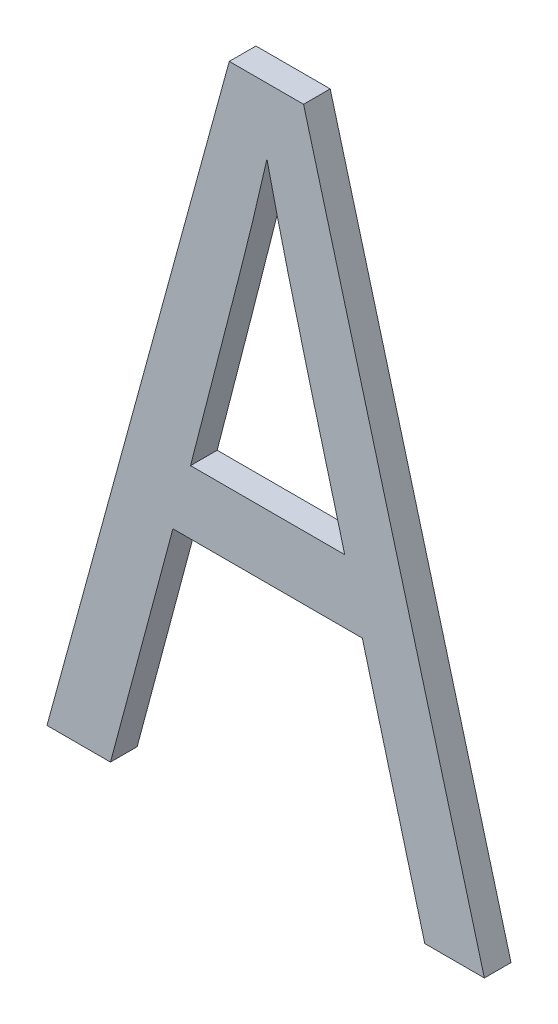
ISO-10303-21;
HEADER;
FILE_DESCRIPTION(('STEP AP214'),'2;1');
FILE_NAME('part.step','',(''),(''),'','','');
FILE_SCHEMA(('AUTOMOTIVE_DESIGN { 1 0 10303 214 1 1 1 1 }'));
ENDSEC;
DATA;
#1=APPLICATION_CONTEXT('core data for automotive mechanical design processes');
#2=APPLICATION_PROTOCOL_DEFINITION('international standard','automotive_design',2000,#1);
#3=PRODUCT_CONTEXT('',#1,'mechanical');
#4=PRODUCT('Part','Part','',(#3));
#5=PRODUCT_RELATED_PRODUCT_CATEGORY('part','',(#4));
#6=PRODUCT_DEFINITION_FORMATION('','',#4);
#7=PRODUCT_DEFINITION_CONTEXT('part definition',#1,'design');
#8=PRODUCT_DEFINITION('design','',#6,#7);
#9=PRODUCT_DEFINITION_SHAPE('','',#8);
#10=(LENGTH_UNIT() NAMED_UNIT(*) SI_UNIT(.MILLI.,.METRE.));
#11=(NAMED_UNIT(*) PLANE_ANGLE_UNIT() SI_UNIT($,.RADIAN.));
#12=(NAMED_UNIT(*) SI_UNIT($,.STERADIAN.) SOLID_ANGLE_UNIT());
#13=UNCERTAINTY_MEASURE_WITH_UNIT(LENGTH_MEASURE(1.E-05),#10,'distance_accuracy_value','');
#14=(GEOMETRIC_REPRESENTATION_CONTEXT(3) GLOBAL_UNCERTAINTY_ASSIGNED_CONTEXT((#13)) GLOBAL_UNIT_ASSIGNED_CONTEXT((#10,
#11,#12)) REPRESENTATION_CONTEXT('',''));
#15=CARTESIAN_POINT('',(0.,0.,0.));
#16=DIRECTION('',(0.,0.,1.));
#17=DIRECTION('',(1.,0.,0.));
#18=AXIS2_PLACEMENT_3D('',#15,#16,#17);
#19=CARTESIAN_POINT('',(161.373182957808,126.608883353261,-39.1));
#20=DIRECTION('',(0.,0.,-1.));
#21=DIRECTION('',(-1.,0.,0.));
#22=AXIS2_PLACEMENT_3D('',#19,#20,#21);
#23=PLANE('',#22);
#24=CARTESIAN_POINT('',(161.510052266919,127.1671696976,-39.1));
#25=CARTESIAN_POINT('',(161.517435763563,127.134663899588,-39.1));
#26=CARTESIAN_POINT('',(161.524951125907,127.102188321371,-39.1));
#27=CARTESIAN_POINT('',(161.536395264339,127.05351530328,-39.1));
#28=CARTESIAN_POINT('',(161.540238480813,127.037297738906,-39.1));
#29=CARTESIAN_POINT('',(161.546042747483,127.012980828554,-39.1));
#30=CARTESIAN_POINT('',(161.547984075584,127.004876769078,-39.1));
#31=CARTESIAN_POINT('',(161.551879443766,126.988671705049,-39.1));
#32=CARTESIAN_POINT('',(161.553833483845,126.980570700495,-39.1));
#33=CARTESIAN_POINT('',(161.557753829251,126.964371661219,-39.1));
#34=CARTESIAN_POINT('',(161.559720134577,126.956273626495,-39.1));
#35=CARTESIAN_POINT('',(161.565636829954,126.93198383587,-39.1));
#36=CARTESIAN_POINT('',(161.569604996497,126.915796405606,-39.1));
#37=CARTESIAN_POINT('',(161.575590537918,126.89152348857,-39.1));
#38=CARTESIAN_POINT('',(161.57759126619,126.883433890835,-39.1));
#39=CARTESIAN_POINT('',(161.581603483805,126.867257363488,-39.1));
#40=CARTESIAN_POINT('',(161.583614973148,126.859170433877,-39.1));
#41=CARTESIAN_POINT('',(161.587648387726,126.842999178711,-39.1));
#42=CARTESIAN_POINT('',(161.589670312961,126.834914853156,-39.1));
#43=CARTESIAN_POINT('',(161.595751282928,126.810665673869,-39.1));
#44=CARTESIAN_POINT('',(161.599825519707,126.79450462644,-39.1));
#45=CARTESIAN_POINT('',(161.605965553908,126.77027033519,-39.1));
#46=CARTESIAN_POINT('',(161.608017011211,126.76219345378,-39.1));
#47=CARTESIAN_POINT('',(161.612129241238,126.746042062139,-39.1));
#48=CARTESIAN_POINT('',(161.614190013962,126.737967551909,-39.1));
#49=CARTESIAN_POINT('',(161.618320580844,126.7218208397,-39.1));
#50=CARTESIAN_POINT('',(161.620390375002,126.71374863772,-39.1));
#51=CARTESIAN_POINT('',(161.626613195052,126.689535478171,-39.1));
#52=CARTESIAN_POINT('',(161.630779656958,126.673397973119,-39.1));
#53=CARTESIAN_POINT('',(161.639140546099,126.64113021702,-39.1));
#54=CARTESIAN_POINT('',(161.643334973328,126.624999965971,-39.1));
#55=CARTESIAN_POINT('',(161.649645501117,126.600809521214,-39.1));
#56=CARTESIAN_POINT('',(161.651752157903,126.592746862747,-39.1));
#57=CARTESIAN_POINT('',(161.658080881588,126.568561174378,-39.1));
#58=CARTESIAN_POINT('',(161.662311701118,126.552440434185,-39.1));
#59=CARTESIAN_POINT('',(161.67079336986,126.520204227042,-39.1));
#60=CARTESIAN_POINT('',(161.675044219069,126.504088760092,-39.1));
#61=CARTESIAN_POINT('',(161.681433002693,126.479918869128,-39.1));
#62=CARTESIAN_POINT('',(161.683564682052,126.471862790951,-39.1));
#63=CARTESIAN_POINT('',(161.689965350958,126.447696046413,-39.1));
#64=CARTESIAN_POINT('',(161.694239971073,126.431586871042,-39.1));
#65=CARTESIAN_POINT('',(161.700660659156,126.407425437448,-39.1));
#66=CARTESIAN_POINT('',(161.702802348086,126.399372014809,-39.1));
#67=CARTESIAN_POINT('',(161.709231169061,126.375212745389,-39.1));
#68=CARTESIAN_POINT('',(161.713522055195,126.35910789748,-39.1));
#69=CARTESIAN_POINT('',(161.722110504658,126.326899983344,-39.1));
#70=CARTESIAN_POINT('',(161.726408067987,126.310796917116,-39.1));
#71=CARTESIAN_POINT('',(161.732856921935,126.286642987885,-39.1));
#72=CARTESIAN_POINT('',(161.735006958061,126.278591789883,-39.1));
#73=CARTESIAN_POINT('',(161.741457696262,126.2544383641,-39.1));
#74=CARTESIAN_POINT('',(161.745759028163,126.23833630453,-39.1));
#75=CARTESIAN_POINT('',(161.752209787055,126.214182884278,-39.1));
#76=CARTESIAN_POINT('',(161.754359833527,126.206131689043,-39.1));
#77=CARTESIAN_POINT('',(161.760808728838,126.181977770947,-39.1));
#78=CARTESIAN_POINT('',(161.765106333537,126.165874715841,-39.1));
#79=CARTESIAN_POINT('',(161.773694893296,126.133666831414,-39.1));
#80=CARTESIAN_POINT('',(161.777985848356,126.117562002093,-39.1));
#81=CARTESIAN_POINT('',(161.784414793521,126.093402765769,-39.1));
#82=CARTESIAN_POINT('',(161.786556527321,126.085349354999,-39.1));
#83=CARTESIAN_POINT('',(161.790894195654,126.069026843694,-39.1));
#84=CARTESIAN_POINT('',(161.793090051425,126.060757722225,-39.1));
#85=CARTESIAN_POINT('',(161.797478241987,126.044218543595,-39.1));
#86=CARTESIAN_POINT('',(161.799670576775,126.035948486433,-39.1));
#87=CARTESIAN_POINT('',(161.801860925255,126.027677903,-39.1));
#88=B_SPLINE_CURVE_WITH_KNOTS('',3,(#24,#25,#26,#27,#28,#29,#30,#31,#32,#33,#34,#35,#36,#37,#38,
#39,#40,#41,#42,#43,#44,#45,#46,#47,#48,#49,#50,#51,#52,#53,#54,#55,#56,#57,#58,#59,#60,#61,#62,
#63,#64,#65,#66,#67,#68,#69,#70,#71,#72,#73,#74,#75,#76,#77,#78,#79,#80,#81,#82,#83,#84,#85,#86,
#87),.UNSPECIFIED.,.F.,.F.,(4,2,2,2,2,2,2,2,2,2,2,2,2,2,2,2,2,2,2,2,2,2,2,2,2,2,2,2,2,2,2,4),
(0.,0.100000764839208,0.150000837838386,0.175000845900893,0.200000853410547,0.225000860419937,
0.275000911743578,0.300000917509053,0.32500092293011,0.350000928035581,0.400000965840457,
0.425000970143834,0.450000974220315,0.475000978086766,0.525001004794338,0.575001022657182,
0.600001024457791,0.650001036364141,0.700001044968254,0.725001045750875,0.775001050405058,
0.800001050777549,0.850001052685995,0.900001053432861,0.925001053456294,0.975001053464078,
1.00000105347876,1.05000105395143,1.1000010554029,1.12500105573741,1.15066818128077,
1.17633531127952),.UNSPECIFIED.);
#89=CARTESIAN_POINT('',(161.510052266919,127.1671696976,-39.1));
#90=VERTEX_POINT('',#89);
#91=CARTESIAN_POINT('',(161.801860925255,126.027677903,-39.1));
#92=VERTEX_POINT('',#91);
#93=EDGE_CURVE('E24',#90,#92,#88,.T.);
#94=ORIENTED_EDGE('',*,*,#93,.F.);
#95=CARTESIAN_POINT('',(161.223292201287,126.027677903,-39.1));
#96=CARTESIAN_POINT('',(161.239935220726,126.092233706417,-39.1));
#97=CARTESIAN_POINT('',(161.256586244339,126.156787476072,-39.1));
#98=CARTESIAN_POINT('',(161.289888209114,126.285894695833,-39.1));
#99=CARTESIAN_POINT('',(161.306539150275,126.35044814594,-39.1));
#100=CARTESIAN_POINT('',(161.339825189205,126.47955975276,-39.1));
#101=CARTESIAN_POINT('',(161.356460286816,126.544117909515,-39.1));
#102=CARTESIAN_POINT('',(161.38510711591,126.655064135204,-39.1));
#103=CARTESIAN_POINT('',(161.397103371138,126.701456136465,-39.1));
#104=CARTESIAN_POINT('',(161.420769082471,126.794322567169,-39.1));
#105=CARTESIAN_POINT('',(161.432438546701,126.840796994532,-39.1));
#106=CARTESIAN_POINT('',(161.45538984158,126.933850480262,-39.1));
#107=CARTESIAN_POINT('',(161.466671603444,126.98042955565,-39.1));
#108=CARTESIAN_POINT('',(161.488750090456,127.073706762007,-39.1));
#109=CARTESIAN_POINT('',(161.499546771949,127.120404903293,-39.1));
#110=CARTESIAN_POINT('',(161.510052266919,127.1671696976,-39.1));
#111=B_SPLINE_CURVE_WITH_KNOTS('',3,(#95,#96,#97,#98,#99,#100,#101,#102,#103,#104,#105,#106,
#107,#108,#109,#110),.UNSPECIFIED.,.F.,.F.,(4,2,2,2,2,2,2,4),(0.,0.200000000000011,
0.399999009959019,0.599999999999992,0.743753425586705,0.887503273823785,1.03127849489464,
1.17506662901091),.UNSPECIFIED.);
#112=CARTESIAN_POINT('',(161.223292201287,126.027677903,-39.1));
#113=VERTEX_POINT('',#112);
#114=EDGE_CURVE('E62',#113,#90,#111,.T.);
#115=ORIENTED_EDGE('',*,*,#114,.F.);
#116=DIRECTION('',(1.,0.,0.));
#117=VECTOR('',#116,1.);
#118=CARTESIAN_POINT('',(161.801860925255,126.027677903,-39.1));
#119=LINE('',#118,#117);
#120=EDGE_CURVE('E126',#92,#113,#119,.F.);
#121=ORIENTED_EDGE('',*,*,#120,.F.);
#122=EDGE_LOOP('',(#94,#115,#121));
#123=FACE_BOUND('',#122,.T.);
#124=DIRECTION('',(0.258484479547322,-0.966015410763798,0.));
#125=VECTOR('',#124,1.);
#126=CARTESIAN_POINT('',(161.867997489688,125.789456621899,-39.1));
#127=LINE('',#126,#125);
#128=CARTESIAN_POINT('',(161.867997489688,125.789456621899,-39.1));
#129=VERTEX_POINT('',#128);
#130=CARTESIAN_POINT('',(162.10225219119,124.913993413852,-39.1));
#131=VERTEX_POINT('',#130);
#132=EDGE_CURVE('E211',#129,#131,#127,.T.);
#133=ORIENTED_EDGE('',*,*,#132,.F.);
#134=DIRECTION('',(1.,0.,0.));
#135=VECTOR('',#134,1.);
#136=CARTESIAN_POINT('',(161.157155636854,125.789456621899,-39.1));
#137=LINE('',#136,#135);
#138=CARTESIAN_POINT('',(161.157155636854,125.789456621899,-39.1));
#139=VERTEX_POINT('',#138);
#140=EDGE_CURVE('E206',#139,#129,#137,.T.);
#141=ORIENTED_EDGE('',*,*,#140,.F.);
#142=DIRECTION('',(0.258484479547336,0.966015410763795,0.));
#143=VECTOR('',#142,1.);
#144=CARTESIAN_POINT('',(160.922900935353,124.913993413852,-39.1));
#145=LINE('',#144,#143);
#146=CARTESIAN_POINT('',(160.922900935353,124.913993413852,-39.1));
#147=VERTEX_POINT('',#146);
#148=EDGE_CURVE('E72',#147,#139,#145,.T.);
#149=ORIENTED_EDGE('',*,*,#148,.F.);
#150=DIRECTION('',(1.,0.,0.));
#151=VECTOR('',#150,1.);
#152=CARTESIAN_POINT('',(160.684607359687,124.913993413852,-39.1));
#153=LINE('',#152,#151);
#154=CARTESIAN_POINT('',(160.684607359687,124.913993413852,-39.1));
#155=VERTEX_POINT('',#154);
#156=EDGE_CURVE('E112',#155,#147,#153,.T.);
#157=ORIENTED_EDGE('',*,*,#156,.F.);
#158=DIRECTION('',(-0.263931093483595,-0.964541537670905,0.));
#159=VECTOR('',#158,1.);
#160=CARTESIAN_POINT('',(161.368691671185,127.413993413853,-39.1));
#161=LINE('',#160,#159);
#162=CARTESIAN_POINT('',(161.368691671185,127.413993413853,-39.1));
#163=VERTEX_POINT('',#162);
#164=EDGE_CURVE('E103',#163,#155,#161,.T.);
#165=ORIENTED_EDGE('',*,*,#164,.F.);
#166=DIRECTION('',(1.,0.,0.));
#167=VECTOR('',#166,1.);
#168=CARTESIAN_POINT('',(161.647373988489,127.413993413853,-39.1));
#169=LINE('',#168,#167);
#170=CARTESIAN_POINT('',(161.647373988489,127.413993413853,-39.1));
#171=VERTEX_POINT('',#170);
#172=EDGE_CURVE('E97',#171,#163,#169,.F.);
#173=ORIENTED_EDGE('',*,*,#172,.F.);
#174=DIRECTION('',(-0.26193604523983,0.965085233647328,0.));
#175=VECTOR('',#174,1.);
#176=CARTESIAN_POINT('',(162.325904848012,124.913993413852,-39.1));
#177=LINE('',#176,#175);
#178=CARTESIAN_POINT('',(162.325904848012,124.913993413852,-39.1));
#179=VERTEX_POINT('',#178);
#180=EDGE_CURVE('E221',#179,#171,#177,.T.);
#181=ORIENTED_EDGE('',*,*,#180,.F.);
#182=DIRECTION('',(1.,0.,0.));
#183=VECTOR('',#182,1.);
#184=CARTESIAN_POINT('',(162.10225219119,124.913993413852,-39.1));
#185=LINE('',#184,#183);
#186=EDGE_CURVE('E216',#131,#179,#185,.T.);
#187=ORIENTED_EDGE('',*,*,#186,.F.);
#188=EDGE_LOOP('',(#133,#141,#149,#157,#165,#173,#181,#187));
#189=FACE_BOUND('',#188,.T.);
#190=ADVANCED_FACE('F17',(#123,#189),#23,.T.);
#191=CARTESIAN_POINT('',(160.684607359687,124.913993413852,-39.1));
#192=DIRECTION('',(0.,-1.,0.));
#193=DIRECTION('',(0.,0.,-1.));
#194=AXIS2_PLACEMENT_3D('',#191,#192,#193);
#195=PLANE('',#194);
#196=ORIENTED_EDGE('',*,*,#156,.T.);
#197=DIRECTION('',(0.,0.,1.));
#198=VECTOR('',#197,1.);
#199=CARTESIAN_POINT('',(160.922900935353,124.913993413852,-39.1));
#200=LINE('',#199,#198);
#201=CARTESIAN_POINT('',(160.922900935353,124.913993413852,-39.));
#202=VERTEX_POINT('',#201);
#203=EDGE_CURVE('E198',#202,#147,#200,.F.);
#204=ORIENTED_EDGE('',*,*,#203,.F.);
#205=DIRECTION('',(-1.,0.,0.));
#206=VECTOR('',#205,1.);
#207=CARTESIAN_POINT('',(161.373182957808,124.913993413852,-39.));
#208=LINE('',#207,#206);
#209=CARTESIAN_POINT('',(160.684607359687,124.913993413852,-39.));
#210=VERTEX_POINT('',#209);
#211=EDGE_CURVE('E121',#202,#210,#208,.T.);
#212=ORIENTED_EDGE('',*,*,#211,.T.);
#213=DIRECTION('',(0.,0.,1.));
#214=VECTOR('',#213,1.);
#215=CARTESIAN_POINT('',(160.684607359687,124.913993413852,-39.1));
#216=LINE('',#215,#214);
#217=EDGE_CURVE('E108',#155,#210,#216,.T.);
#218=ORIENTED_EDGE('',*,*,#217,.F.);
#219=EDGE_LOOP('',(#196,#204,#212,#218));
#220=FACE_BOUND('',#219,.T.);
#221=ADVANCED_FACE('F119',(#220),#195,.T.);
#222=CARTESIAN_POINT('',(161.368691671185,127.413993413853,-39.1));
#223=DIRECTION('',(-0.964541537670905,0.263931093483595,0.));
#224=DIRECTION('',(-0.263931093483595,-0.964541537670905,0.));
#225=AXIS2_PLACEMENT_3D('',#222,#223,#224);
#226=PLANE('',#225);
#227=ORIENTED_EDGE('',*,*,#164,.T.);
#228=ORIENTED_EDGE('',*,*,#217,.T.);
#229=DIRECTION('',(0.26393109348361,0.964541537670901,0.));
#230=VECTOR('',#229,1.);
#231=CARTESIAN_POINT('',(160.684607359687,124.913993413852,-39.));
#232=LINE('',#231,#230);
#233=CARTESIAN_POINT('',(161.368691671185,127.413993413853,-39.));
#234=VERTEX_POINT('',#233);
#235=EDGE_CURVE('E231',#210,#234,#232,.T.);
#236=ORIENTED_EDGE('',*,*,#235,.T.);
#237=DIRECTION('',(0.,0.,1.));
#238=VECTOR('',#237,1.);
#239=CARTESIAN_POINT('',(161.368691671185,127.413993413853,-39.1));
#240=LINE('',#239,#238);
#241=EDGE_CURVE('E110',#163,#234,#240,.T.);
#242=ORIENTED_EDGE('',*,*,#241,.F.);
#243=EDGE_LOOP('',(#227,#228,#236,#242));
#244=FACE_BOUND('',#243,.T.);
#245=ADVANCED_FACE('F105',(#244),#226,.T.);
#246=CARTESIAN_POINT('',(161.647373988489,127.413993413853,-39.1));
#247=DIRECTION('',(0.,1.,0.));
#248=DIRECTION('',(0.,0.,1.));
#249=AXIS2_PLACEMENT_3D('',#246,#247,#248);
#250=PLANE('',#249);
#251=ORIENTED_EDGE('',*,*,#172,.T.);
#252=ORIENTED_EDGE('',*,*,#241,.T.);
#253=DIRECTION('',(-1.,0.,0.));
#254=VECTOR('',#253,1.);
#255=CARTESIAN_POINT('',(161.373182957808,127.413993413853,-39.));
#256=LINE('',#255,#254);
#257=CARTESIAN_POINT('',(161.647373988489,127.413993413853,-39.));
#258=VERTEX_POINT('',#257);
#259=EDGE_CURVE('E226',#234,#258,#256,.F.);
#260=ORIENTED_EDGE('',*,*,#259,.T.);
#261=DIRECTION('',(0.,0.,1.));
#262=VECTOR('',#261,1.);
#263=CARTESIAN_POINT('',(161.647373988489,127.413993413853,-39.1));
#264=LINE('',#263,#262);
#265=EDGE_CURVE('E218',#171,#258,#264,.T.);
#266=ORIENTED_EDGE('',*,*,#265,.F.);
#267=EDGE_LOOP('',(#251,#252,#260,#266));
#268=FACE_BOUND('',#267,.T.);
#269=ADVANCED_FACE('F169',(#268),#250,.T.);
#270=CARTESIAN_POINT('',(162.325904848012,124.913993413852,-39.1));
#271=DIRECTION('',(0.965085233647328,0.26193604523983,0.));
#272=DIRECTION('',(-0.26193604523983,0.965085233647328,0.));
#273=AXIS2_PLACEMENT_3D('',#270,#271,#272);
#274=PLANE('',#273);
#275=ORIENTED_EDGE('',*,*,#180,.T.);
#276=ORIENTED_EDGE('',*,*,#265,.T.);
#277=DIRECTION('',(0.261936045239833,-0.965085233647327,0.));
#278=VECTOR('',#277,1.);
#279=CARTESIAN_POINT('',(161.647373988489,127.413993413853,-39.));
#280=LINE('',#279,#278);
#281=CARTESIAN_POINT('',(162.325904848012,124.913993413852,-39.));
#282=VERTEX_POINT('',#281);
#283=EDGE_CURVE('E234',#258,#282,#280,.T.);
#284=ORIENTED_EDGE('',*,*,#283,.T.);
#285=DIRECTION('',(0.,0.,-1.));
#286=VECTOR('',#285,1.);
#287=CARTESIAN_POINT('',(162.325904848012,124.913993413852,-39.1));
#288=LINE('',#287,#286);
#289=EDGE_CURVE('E213',#179,#282,#288,.F.);
#290=ORIENTED_EDGE('',*,*,#289,.F.);
#291=EDGE_LOOP('',(#275,#276,#284,#290));
#292=FACE_BOUND('',#291,.T.);
#293=ADVANCED_FACE('F165',(#292),#274,.T.);
#294=CARTESIAN_POINT('',(162.10225219119,124.913993413852,-39.1));
#295=DIRECTION('',(0.,-1.,0.));
#296=DIRECTION('',(0.,0.,-1.));
#297=AXIS2_PLACEMENT_3D('',#294,#295,#296);
#298=PLANE('',#297);
#299=ORIENTED_EDGE('',*,*,#186,.T.);
#300=ORIENTED_EDGE('',*,*,#289,.T.);
#301=DIRECTION('',(-1.,0.,0.));
#302=VECTOR('',#301,1.);
#303=CARTESIAN_POINT('',(161.373182957808,124.913993413852,-39.));
#304=LINE('',#303,#302);
#305=CARTESIAN_POINT('',(162.10225219119,124.913993413852,-39.));
#306=VERTEX_POINT('',#305);
#307=EDGE_CURVE('E252',#282,#306,#304,.T.);
#308=ORIENTED_EDGE('',*,*,#307,.T.);
#309=DIRECTION('',(0.,0.,1.));
#310=VECTOR('',#309,1.);
#311=CARTESIAN_POINT('',(162.10225219119,124.913993413852,-39.1));
#312=LINE('',#311,#310);
#313=EDGE_CURVE('E208',#131,#306,#312,.T.);
#314=ORIENTED_EDGE('',*,*,#313,.F.);
#315=EDGE_LOOP('',(#299,#300,#308,#314));
#316=FACE_BOUND('',#315,.T.);
#317=ADVANCED_FACE('F161',(#316),#298,.T.);
#318=CARTESIAN_POINT('',(161.867997489688,125.789456621899,-39.1));
#319=DIRECTION('',(-0.966015410763798,-0.258484479547322,0.));
#320=DIRECTION('',(0.258484479547322,-0.966015410763798,0.));
#321=AXIS2_PLACEMENT_3D('',#318,#319,#320);
#322=PLANE('',#321);
#323=ORIENTED_EDGE('',*,*,#132,.T.);
#324=ORIENTED_EDGE('',*,*,#313,.T.);
#325=DIRECTION('',(-0.258484479547393,0.966015410763779,0.));
#326=VECTOR('',#325,1.);
#327=CARTESIAN_POINT('',(162.10225219119,124.913993413852,-39.));
#328=LINE('',#327,#326);
#329=CARTESIAN_POINT('',(161.867997489688,125.789456621899,-39.));
#330=VERTEX_POINT('',#329);
#331=EDGE_CURVE('E247',#306,#330,#328,.T.);
#332=ORIENTED_EDGE('',*,*,#331,.T.);
#333=DIRECTION('',(0.,0.,-1.));
#334=VECTOR('',#333,1.);
#335=CARTESIAN_POINT('',(161.867997489688,125.789456621899,-39.1));
#336=LINE('',#335,#334);
#337=EDGE_CURVE('E203',#129,#330,#336,.F.);
#338=ORIENTED_EDGE('',*,*,#337,.F.);
#339=EDGE_LOOP('',(#323,#324,#332,#338));
#340=FACE_BOUND('',#339,.T.);
#341=ADVANCED_FACE('F157',(#340),#322,.T.);
#342=CARTESIAN_POINT('',(161.157155636854,125.789456621899,-39.1));
#343=DIRECTION('',(0.,-1.,0.));
#344=DIRECTION('',(0.,0.,-1.));
#345=AXIS2_PLACEMENT_3D('',#342,#343,#344);
#346=PLANE('',#345);
#347=ORIENTED_EDGE('',*,*,#140,.T.);
#348=ORIENTED_EDGE('',*,*,#337,.T.);
#349=DIRECTION('',(-1.,0.,0.));
#350=VECTOR('',#349,1.);
#351=CARTESIAN_POINT('',(161.373182957808,125.789456621899,-39.));
#352=LINE('',#351,#350);
#353=CARTESIAN_POINT('',(161.157155636854,125.789456621899,-39.));
#354=VERTEX_POINT('',#353);
#355=EDGE_CURVE('E244',#330,#354,#352,.T.);
#356=ORIENTED_EDGE('',*,*,#355,.T.);
#357=DIRECTION('',(0.,0.,1.));
#358=VECTOR('',#357,1.);
#359=CARTESIAN_POINT('',(161.157155636854,125.789456621899,-39.1));
#360=LINE('',#359,#358);
#361=EDGE_CURVE('E189',#139,#354,#360,.T.);
#362=ORIENTED_EDGE('',*,*,#361,.F.);
#363=EDGE_LOOP('',(#347,#348,#356,#362));
#364=FACE_BOUND('',#363,.T.);
#365=ADVANCED_FACE('F154',(#364),#346,.T.);
#366=CARTESIAN_POINT('',(160.922900935353,124.913993413852,-39.1));
#367=DIRECTION('',(0.966015410763795,-0.258484479547336,0.));
#368=DIRECTION('',(0.258484479547336,0.966015410763795,0.));
#369=AXIS2_PLACEMENT_3D('',#366,#367,#368);
#370=PLANE('',#369);
#371=ORIENTED_EDGE('',*,*,#148,.T.);
#372=ORIENTED_EDGE('',*,*,#361,.T.);
#373=DIRECTION('',(-0.258484479547364,-0.966015410763787,0.));
#374=VECTOR('',#373,1.);
#375=CARTESIAN_POINT('',(161.157155636854,125.789456621899,-39.));
#376=LINE('',#375,#374);
#377=EDGE_CURVE('E243',#354,#202,#376,.T.);
#378=ORIENTED_EDGE('',*,*,#377,.T.);
#379=ORIENTED_EDGE('',*,*,#203,.T.);
#380=EDGE_LOOP('',(#371,#372,#378,#379));
#381=FACE_BOUND('',#380,.T.);
#382=ADVANCED_FACE('F150',(#381),#370,.T.);
#383=CARTESIAN_POINT('',(161.510052266919,127.1671696976,-39.1));
#384=CARTESIAN_POINT('',(161.510052266919,127.1671696976,-39.));
#385=CARTESIAN_POINT('',(161.54236326023,127.024898654721,-39.1));
#386=CARTESIAN_POINT('',(161.54236326023,127.024898654721,-39.));
#387=CARTESIAN_POINT('',(161.581742283327,126.863437564197,-39.1));
#388=CARTESIAN_POINT('',(161.581742283327,126.863437564197,-39.));
#389=CARTESIAN_POINT('',(161.684691151942,126.46449500019,-39.1));
#390=CARTESIAN_POINT('',(161.684691151942,126.46449500019,-39.));
#391=CARTESIAN_POINT('',(161.743970395574,126.246267985936,-39.1));
#392=CARTESIAN_POINT('',(161.743970395574,126.246267985936,-39.));
#393=CARTESIAN_POINT('',(161.801860925255,126.027677903,-39.1));
#394=CARTESIAN_POINT('',(161.801860925255,126.027677903,-39.));
#395=B_SPLINE_SURFACE_WITH_KNOTS('',3,1,((#383,#384),(#385,#386),(#387,#388),(#389,#390),(#391,
#392),(#393,#394)),.UNSPECIFIED.,.F.,.F.,.F.,(4,2,4),(2,2),(0.,0.45116622949396,1.),(1.,1.1),.UNSPECIFIED.);
#396=DIRECTION('',(0.,0.,1.));
#397=VECTOR('',#396,1.);
#398=CARTESIAN_POINT('',(161.801860925255,126.027677903,-39.1));
#399=LINE('',#398,#397);
#400=CARTESIAN_POINT('',(161.801860925255,126.027677903,-39.));
#401=VERTEX_POINT('',#400);
#402=EDGE_CURVE('E128',#401,#92,#399,.F.);
#403=CARTESIAN_POINT('',(161.801860925255,126.027677903,-39.));
#404=CARTESIAN_POINT('',(161.793327247241,126.059900398318,-39.));
#405=CARTESIAN_POINT('',(161.784763425576,126.092114882009,-39.));
#406=CARTESIAN_POINT('',(161.771892477648,126.140429887587,-39.));
#407=CARTESIAN_POINT('',(161.767597959731,126.156533767097,-39.));
#408=CARTESIAN_POINT('',(161.754706797422,126.204843373233,-39.));
#409=CARTESIAN_POINT('',(161.746102544389,126.237047067783,-39.));
#410=CARTESIAN_POINT('',(161.728900400977,126.301456160586,-39.));
#411=CARTESIAN_POINT('',(161.720302510597,126.333661558838,-39.));
#412=CARTESIAN_POINT('',(161.707430436598,126.381976253547,-39.));
#413=CARTESIAN_POINT('',(161.703143872162,126.398082251453,-39.));
#414=CARTESIAN_POINT('',(161.690301566577,126.44640488688,-39.));
#415=CARTESIAN_POINT('',(161.681763215949,126.478626155632,-39.));
#416=CARTESIAN_POINT('',(161.669010429447,126.526972489174,-39.));
#417=CARTESIAN_POINT('',(161.664768624247,126.543090337249,-39.));
#418=CARTESIAN_POINT('',(161.652075746591,126.591452473074,-39.));
#419=CARTESIAN_POINT('',(161.643657219877,126.623705323045,-39.));
#420=CARTESIAN_POINT('',(161.631113503204,126.672106358568,-39.));
#421=CARTESIAN_POINT('',(161.626946277898,126.688243658545,-39.));
#422=CARTESIAN_POINT('',(161.614497660852,126.736669308453,-39.));
#423=CARTESIAN_POINT('',(161.606269345894,126.768971339945,-39.));
#424=CARTESIAN_POINT('',(161.594044416499,126.817453951016,-39.));
#425=CARTESIAN_POINT('',(161.589989034119,126.833619734194,-39.));
#426=CARTESIAN_POINT('',(161.581919959137,126.865961709658,-39.));
#427=CARTESIAN_POINT('',(161.57790626654,126.882137901945,-39.));
#428=CARTESIAN_POINT('',(161.56992317635,126.914501218635,-39.));
#429=CARTESIAN_POINT('',(161.565953778764,126.93068834304,-39.));
#430=CARTESIAN_POINT('',(161.558062340647,126.963074128476,-39.));
#431=CARTESIAN_POINT('',(161.554140300125,126.979272789509,-39.));
#432=CARTESIAN_POINT('',(161.543372282669,127.024051528891,-39.));
#433=CARTESIAN_POINT('',(161.536579579015,127.052644456054,-39.));
#434=CARTESIAN_POINT('',(161.523174610465,127.109873700262,-39.));
#435=CARTESIAN_POINT('',(161.51656235246,127.138510018921,-39.));
#436=CARTESIAN_POINT('',(161.510052266919,127.1671696976,-39.));
#437=B_SPLINE_CURVE_WITH_KNOTS('',3,(#403,#404,#405,#406,#407,#408,#409,#410,#411,#412,#413,
#414,#415,#416,#417,#418,#419,#420,#421,#422,#423,#424,#425,#426,#427,#428,#429,#430,#431,#432,
#433,#434,#435,#436),.UNSPECIFIED.,.F.,.F.,(4,2,2,2,2,2,2,2,2,2,2,2,2,2,2,2,4),(0.,
0.100000031822697,0.150000033104873,0.250000034672701,0.350000037474385,0.4000000395881,
0.500000076346715,0.55000008538087,0.650000194628219,0.700000216479095,0.800000472344762,
0.85000051076235,0.900000554003063,0.95000060298905,1.00000065888157,1.08816620903135,
1.17633512164848),.UNSPECIFIED.);
#438=CARTESIAN_POINT('',(161.510052266919,127.1671696976,-39.));
#439=VERTEX_POINT('',#438);
#440=EDGE_CURVE('E136',#401,#439,#437,.T.);
#441=DIRECTION('',(0.,0.,1.));
#442=VECTOR('',#441,1.);
#443=CARTESIAN_POINT('',(161.510052266919,127.1671696976,-39.05));
#444=LINE('',#443,#442);
#445=EDGE_CURVE('E187',#90,#439,#444,.T.);
#446=ORIENTED_EDGE('',*,*,#93,.T.);
#447=ORIENTED_EDGE('',*,*,#402,.F.);
#448=ORIENTED_EDGE('',*,*,#440,.T.);
#449=ORIENTED_EDGE('',*,*,#445,.F.);
#450=EDGE_LOOP('',(#446,#447,#448,#449));
#451=FACE_BOUND('',#450,.T.);
#452=ADVANCED_FACE('F153',(#451),#395,.T.);
#453=CARTESIAN_POINT('',(161.223292201287,126.027677903,-39.1));
#454=CARTESIAN_POINT('',(161.223292201287,126.027677903,-39.));
#455=CARTESIAN_POINT('',(161.279836439581,126.246929711717,-39.1));
#456=CARTESIAN_POINT('',(161.279836439581,126.246929711717,-39.));
#457=CARTESIAN_POINT('',(161.336380677874,126.466181520434,-39.1));
#458=CARTESIAN_POINT('',(161.336380677874,126.466181520434,-39.));
#459=CARTESIAN_POINT('',(161.436307848888,126.853651820609,-39.1));
#460=CARTESIAN_POINT('',(161.436307848888,126.853651820609,-39.));
#461=CARTESIAN_POINT('',(161.475721836526,127.014311042227,-39.1));
#462=CARTESIAN_POINT('',(161.475721836526,127.014311042227,-39.));
#463=CARTESIAN_POINT('',(161.510052266919,127.1671696976,-39.1));
#464=CARTESIAN_POINT('',(161.510052266919,127.1671696976,-39.));
#465=B_SPLINE_SURFACE_WITH_KNOTS('',3,1,((#453,#454),(#455,#456),(#457,#458),(#459,#460),(#461,
#462),(#463,#464)),.UNSPECIFIED.,.F.,.F.,.F.,(4,2,4),(2,2),(0.,0.565854489024155,1.),(1.,1.1),.UNSPECIFIED.);
#466=CARTESIAN_POINT('',(161.510052266919,127.1671696976,-39.));
#467=CARTESIAN_POINT('',(161.495421272683,127.102124029348,-39.));
#468=CARTESIAN_POINT('',(161.480254471155,127.037201764327,-39.));
#469=CARTESIAN_POINT('',(161.449050295162,126.90756638735,-39.));
#470=CARTESIAN_POINT('',(161.433012921587,126.84285327518,-39.));
#471=CARTESIAN_POINT('',(161.400267493915,126.713594002499,-39.));
#472=CARTESIAN_POINT('',(161.383559394074,126.649047853696,-39.));
#473=CARTESIAN_POINT('',(161.354912615793,126.538090218466,-39.));
#474=CARTESIAN_POINT('',(161.342954099913,126.491683767088,-39.));
#475=CARTESIAN_POINT('',(161.319025773926,126.398873786968,-39.));
#476=CARTESIAN_POINT('',(161.307055963832,126.352470258223,-39.));
#477=CARTESIAN_POINT('',(161.28312073761,126.259668558141,-39.));
#478=CARTESIAN_POINT('',(161.271155321113,126.213270386897,-39.));
#479=CARTESIAN_POINT('',(161.247224474571,126.120473991872,-39.));
#480=CARTESIAN_POINT('',(161.235259044527,126.074075768091,-39.));
#481=CARTESIAN_POINT('',(161.223292201287,126.027677903,-39.));
#482=B_SPLINE_CURVE_WITH_KNOTS('',3,(#466,#467,#468,#469,#470,#471,#472,#473,#474,#475,#476,
#477,#478,#479,#480,#481),.UNSPECIFIED.,.F.,.F.,(4,2,2,2,2,2,2,4),(0.,0.200006503710232,
0.400012802884756,0.600032765794508,0.743800332480169,0.88756773636399,1.0313163189105,
1.17506506422335),.UNSPECIFIED.);
#483=CARTESIAN_POINT('',(161.223292201287,126.027677903,-39.));
#484=VERTEX_POINT('',#483);
#485=EDGE_CURVE('E35',#439,#484,#482,.T.);
#486=DIRECTION('',(0.,0.,1.));
#487=VECTOR('',#486,1.);
#488=CARTESIAN_POINT('',(161.223292201287,126.027677903,-39.1));
#489=LINE('',#488,#487);
#490=EDGE_CURVE('E43',#113,#484,#489,.T.);
#491=ORIENTED_EDGE('',*,*,#114,.T.);
#492=ORIENTED_EDGE('',*,*,#445,.T.);
#493=ORIENTED_EDGE('',*,*,#485,.T.);
#494=ORIENTED_EDGE('',*,*,#490,.F.);
#495=EDGE_LOOP('',(#491,#492,#493,#494));
#496=FACE_BOUND('',#495,.T.);
#497=ADVANCED_FACE('F19',(#496),#465,.T.);
#498=CARTESIAN_POINT('',(161.801860925255,126.027677903,-39.1));
#499=DIRECTION('',(0.,1.,0.));
#500=DIRECTION('',(0.,0.,1.));
#501=AXIS2_PLACEMENT_3D('',#498,#499,#500);
#502=PLANE('',#501);
#503=ORIENTED_EDGE('',*,*,#120,.T.);
#504=ORIENTED_EDGE('',*,*,#490,.T.);
#505=DIRECTION('',(-1.,0.,0.));
#506=VECTOR('',#505,1.);
#507=CARTESIAN_POINT('',(161.373182957808,126.027677903,-39.));
#508=LINE('',#507,#506);
#509=EDGE_CURVE('E11',#484,#401,#508,.F.);
#510=ORIENTED_EDGE('',*,*,#509,.T.);
#511=ORIENTED_EDGE('',*,*,#402,.T.);
#512=EDGE_LOOP('',(#503,#504,#510,#511));
#513=FACE_BOUND('',#512,.T.);
#514=ADVANCED_FACE('F145',(#513),#502,.T.);
#515=CARTESIAN_POINT('',(161.373182957808,126.608883353261,-39.));
#516=DIRECTION('',(0.,0.,-1.));
#517=DIRECTION('',(-1.,0.,0.));
#518=AXIS2_PLACEMENT_3D('',#515,#516,#517);
#519=PLANE('',#518);
#520=ORIENTED_EDGE('',*,*,#485,.F.);
#521=ORIENTED_EDGE('',*,*,#440,.F.);
#522=ORIENTED_EDGE('',*,*,#509,.F.);
#523=EDGE_LOOP('',(#520,#521,#522));
#524=FACE_BOUND('',#523,.T.);
#525=ORIENTED_EDGE('',*,*,#355,.F.);
#526=ORIENTED_EDGE('',*,*,#331,.F.);
#527=ORIENTED_EDGE('',*,*,#307,.F.);
#528=ORIENTED_EDGE('',*,*,#283,.F.);
#529=ORIENTED_EDGE('',*,*,#259,.F.);
#530=ORIENTED_EDGE('',*,*,#235,.F.);
#531=ORIENTED_EDGE('',*,*,#211,.F.);
#532=ORIENTED_EDGE('',*,*,#377,.F.);
#533=EDGE_LOOP('',(#525,#526,#527,#528,#529,#530,#531,#532));
#534=FACE_BOUND('',#533,.T.);
#535=ADVANCED_FACE('F141',(#524,#534),#519,.F.);
#536=CLOSED_SHELL('',(#190,#221,#245,#269,#293,#317,#341,#365,#382,#452,#497,#514,#535));
#537=MANIFOLD_SOLID_BREP('B1',#536);
#538=ADVANCED_BREP_SHAPE_REPRESENTATION('',(#18,#537),#14);
#539=SHAPE_DEFINITION_REPRESENTATION(#9,#538);
ENDSEC;
END-ISO-10303-21;
